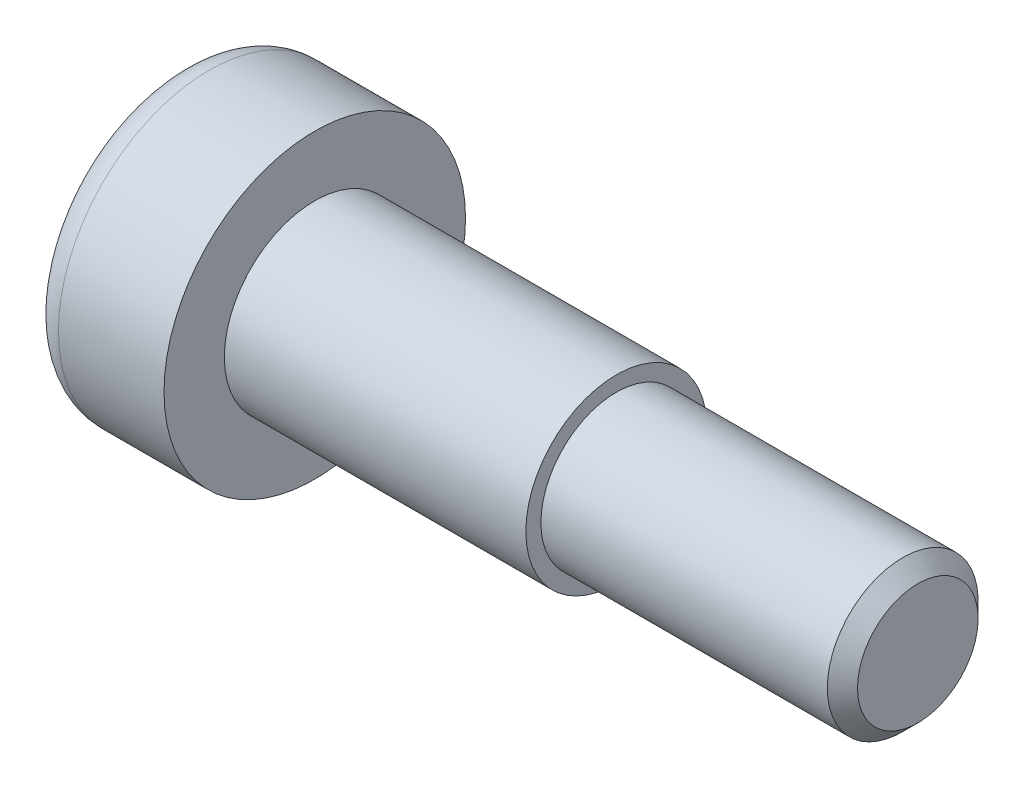
ISO-10303-21;
HEADER;
FILE_DESCRIPTION(('STEP AP214'),'2;1');
FILE_NAME('part.step','',(''),(''),'','','');
FILE_SCHEMA(('AUTOMOTIVE_DESIGN { 1 0 10303 214 1 1 1 1 }'));
ENDSEC;
DATA;
#1=APPLICATION_CONTEXT('core data for automotive mechanical design processes');
#2=APPLICATION_PROTOCOL_DEFINITION('international standard','automotive_design',2000,#1);
#3=PRODUCT_CONTEXT('',#1,'mechanical');
#4=PRODUCT('Part','Part','',(#3));
#5=PRODUCT_RELATED_PRODUCT_CATEGORY('part','',(#4));
#6=PRODUCT_DEFINITION_FORMATION('','',#4);
#7=PRODUCT_DEFINITION_CONTEXT('part definition',#1,'design');
#8=PRODUCT_DEFINITION('design','',#6,#7);
#9=PRODUCT_DEFINITION_SHAPE('','',#8);
#10=(LENGTH_UNIT() NAMED_UNIT(*) SI_UNIT(.MILLI.,.METRE.));
#11=(NAMED_UNIT(*) PLANE_ANGLE_UNIT() SI_UNIT($,.RADIAN.));
#12=(NAMED_UNIT(*) SI_UNIT($,.STERADIAN.) SOLID_ANGLE_UNIT());
#13=UNCERTAINTY_MEASURE_WITH_UNIT(LENGTH_MEASURE(1.E-05),#10,'distance_accuracy_value','');
#14=(GEOMETRIC_REPRESENTATION_CONTEXT(3) GLOBAL_UNCERTAINTY_ASSIGNED_CONTEXT((#13)) GLOBAL_UNIT_ASSIGNED_CONTEXT((#10,
#11,#12)) REPRESENTATION_CONTEXT('',''));
#15=CARTESIAN_POINT('',(0.,0.,0.));
#16=DIRECTION('',(0.,0.,1.));
#17=DIRECTION('',(1.,0.,0.));
#18=AXIS2_PLACEMENT_3D('',#15,#16,#17);
#19=CARTESIAN_POINT('',(0.,0.,0.));
#20=DIRECTION('',(1.,0.,0.));
#21=DIRECTION('',(0.,0.,-1.));
#22=AXIS2_PLACEMENT_3D('',#19,#20,#21);
#23=PLANE('',#22);
#24=CARTESIAN_POINT('',(0.,0.,0.));
#25=DIRECTION('',(1.,0.,0.));
#26=DIRECTION('',(0.,0.,-1.));
#27=AXIS2_PLACEMENT_3D('',#24,#25,#26);
#28=CIRCLE('',#27,4.);
#29=CARTESIAN_POINT('',(0.,0.,-4.));
#30=VERTEX_POINT('',#29);
#31=EDGE_CURVE('E157',#30,#30,#28,.F.);
#32=ORIENTED_EDGE('',*,*,#31,.T.);
#33=EDGE_LOOP('',(#32));
#34=FACE_BOUND('',#33,.T.);
#35=DIRECTION('',(0.,-0.5,-0.866025403784439));
#36=VECTOR('',#35,1.);
#37=CARTESIAN_POINT('',(0.,1.73205080756888,0.));
#38=LINE('',#37,#36);
#39=CARTESIAN_POINT('',(0.,1.73205080756888,0.));
#40=VERTEX_POINT('',#39);
#41=CARTESIAN_POINT('',(0.,0.866025403784439,-1.5));
#42=VERTEX_POINT('',#41);
#43=EDGE_CURVE('E127',#40,#42,#38,.T.);
#44=ORIENTED_EDGE('',*,*,#43,.F.);
#45=DIRECTION('',(0.,0.5,-0.866025403784439));
#46=VECTOR('',#45,1.);
#47=CARTESIAN_POINT('',(0.,0.86602540378444,1.5));
#48=LINE('',#47,#46);
#49=CARTESIAN_POINT('',(0.,0.86602540378444,1.5));
#50=VERTEX_POINT('',#49);
#51=EDGE_CURVE('E53',#50,#40,#48,.T.);
#52=ORIENTED_EDGE('',*,*,#51,.F.);
#53=DIRECTION('',(0.,1.,0.));
#54=VECTOR('',#53,1.);
#55=CARTESIAN_POINT('',(0.,-0.866025403784439,1.5));
#56=LINE('',#55,#54);
#57=CARTESIAN_POINT('',(0.,-0.866025403784439,1.5));
#58=VERTEX_POINT('',#57);
#59=EDGE_CURVE('E136',#58,#50,#56,.T.);
#60=ORIENTED_EDGE('',*,*,#59,.F.);
#61=DIRECTION('',(0.,0.5,0.866025403784439));
#62=VECTOR('',#61,1.);
#63=CARTESIAN_POINT('',(0.,-1.73205080756888,0.));
#64=LINE('',#63,#62);
#65=CARTESIAN_POINT('',(0.,-1.73205080756888,0.));
#66=VERTEX_POINT('',#65);
#67=EDGE_CURVE('E134',#66,#58,#64,.T.);
#68=ORIENTED_EDGE('',*,*,#67,.F.);
#69=DIRECTION('',(0.,-0.5,0.866025403784439));
#70=VECTOR('',#69,1.);
#71=CARTESIAN_POINT('',(0.,-0.866025403784439,-1.5));
#72=LINE('',#71,#70);
#73=CARTESIAN_POINT('',(0.,-0.866025403784439,-1.5));
#74=VERTEX_POINT('',#73);
#75=EDGE_CURVE('E101',#74,#66,#72,.T.);
#76=ORIENTED_EDGE('',*,*,#75,.F.);
#77=DIRECTION('',(0.,-1.,0.));
#78=VECTOR('',#77,1.);
#79=CARTESIAN_POINT('',(0.,0.866025403784439,-1.5));
#80=LINE('',#79,#78);
#81=EDGE_CURVE('E130',#42,#74,#80,.T.);
#82=ORIENTED_EDGE('',*,*,#81,.F.);
#83=EDGE_LOOP('',(#44,#52,#60,#68,#76,#82));
#84=FACE_BOUND('',#83,.T.);
#85=ADVANCED_FACE('F38',(#34,#84),#23,.F.);
#86=CARTESIAN_POINT('',(0.,0.,0.));
#87=DIRECTION('',(-1.,0.,0.));
#88=DIRECTION('',(0.,0.,1.));
#89=AXIS2_PLACEMENT_3D('',#86,#87,#88);
#90=CYLINDRICAL_SURFACE('',#89,5.);
#91=CARTESIAN_POINT('',(1.,0.,0.));
#92=DIRECTION('',(1.,0.,0.));
#93=DIRECTION('',(0.,0.,-1.));
#94=AXIS2_PLACEMENT_3D('',#91,#92,#93);
#95=CIRCLE('',#94,5.);
#96=CARTESIAN_POINT('',(1.,0.,-5.));
#97=VERTEX_POINT('',#96);
#98=EDGE_CURVE('E160',#97,#97,#95,.T.);
#99=ORIENTED_EDGE('',*,*,#98,.T.);
#100=EDGE_LOOP('',(#99));
#101=FACE_BOUND('',#100,.T.);
#102=CARTESIAN_POINT('',(4.5,0.,0.));
#103=DIRECTION('',(-1.,0.,0.));
#104=DIRECTION('',(0.,0.,1.));
#105=AXIS2_PLACEMENT_3D('',#102,#103,#104);
#106=CIRCLE('',#105,5.);
#107=CARTESIAN_POINT('',(4.5,0.,5.));
#108=VERTEX_POINT('',#107);
#109=EDGE_CURVE('E154',#108,#108,#106,.T.);
#110=ORIENTED_EDGE('',*,*,#109,.T.);
#111=EDGE_LOOP('',(#110));
#112=FACE_BOUND('',#111,.T.);
#113=ADVANCED_FACE('F177',(#101,#112),#90,.T.);
#114=CARTESIAN_POINT('',(4.5,5.,0.));
#115=DIRECTION('',(-1.,0.,0.));
#116=DIRECTION('',(0.,0.,1.));
#117=AXIS2_PLACEMENT_3D('',#114,#115,#116);
#118=PLANE('',#117);
#119=ORIENTED_EDGE('',*,*,#109,.F.);
#120=EDGE_LOOP('',(#119));
#121=FACE_BOUND('',#120,.T.);
#122=CARTESIAN_POINT('',(4.5,0.,0.));
#123=DIRECTION('',(-1.,0.,0.));
#124=DIRECTION('',(0.,0.,1.));
#125=AXIS2_PLACEMENT_3D('',#122,#123,#124);
#126=CIRCLE('',#125,3.);
#127=CARTESIAN_POINT('',(4.5,0.,3.));
#128=VERTEX_POINT('',#127);
#129=EDGE_CURVE('E151',#128,#128,#126,.T.);
#130=ORIENTED_EDGE('',*,*,#129,.T.);
#131=EDGE_LOOP('',(#130));
#132=FACE_BOUND('',#131,.T.);
#133=ADVANCED_FACE('F183',(#121,#132),#118,.F.);
#134=CARTESIAN_POINT('',(0.,0.,0.));
#135=DIRECTION('',(-1.,0.,0.));
#136=DIRECTION('',(0.,0.,1.));
#137=AXIS2_PLACEMENT_3D('',#134,#135,#136);
#138=CYLINDRICAL_SURFACE('',#137,3.);
#139=ORIENTED_EDGE('',*,*,#129,.F.);
#140=EDGE_LOOP('',(#139));
#141=FACE_BOUND('',#140,.T.);
#142=CARTESIAN_POINT('',(14.5,0.,0.));
#143=DIRECTION('',(-1.,0.,0.));
#144=DIRECTION('',(0.,0.,1.));
#145=AXIS2_PLACEMENT_3D('',#142,#143,#144);
#146=CIRCLE('',#145,3.);
#147=CARTESIAN_POINT('',(14.5,0.,3.));
#148=VERTEX_POINT('',#147);
#149=EDGE_CURVE('E148',#148,#148,#146,.T.);
#150=ORIENTED_EDGE('',*,*,#149,.T.);
#151=EDGE_LOOP('',(#150));
#152=FACE_BOUND('',#151,.T.);
#153=ADVANCED_FACE('F190',(#141,#152),#138,.T.);
#154=CARTESIAN_POINT('',(14.5,3.,0.));
#155=DIRECTION('',(-1.,0.,0.));
#156=DIRECTION('',(0.,0.,1.));
#157=AXIS2_PLACEMENT_3D('',#154,#155,#156);
#158=PLANE('',#157);
#159=ORIENTED_EDGE('',*,*,#149,.F.);
#160=EDGE_LOOP('',(#159));
#161=FACE_BOUND('',#160,.T.);
#162=CARTESIAN_POINT('',(14.5,0.,0.));
#163=DIRECTION('',(-1.,0.,0.));
#164=DIRECTION('',(0.,0.,1.));
#165=AXIS2_PLACEMENT_3D('',#162,#163,#164);
#166=CIRCLE('',#165,2.5);
#167=CARTESIAN_POINT('',(14.5,0.,2.5));
#168=VERTEX_POINT('',#167);
#169=EDGE_CURVE('E140',#168,#168,#166,.T.);
#170=ORIENTED_EDGE('',*,*,#169,.T.);
#171=EDGE_LOOP('',(#170));
#172=FACE_BOUND('',#171,.T.);
#173=ADVANCED_FACE('F194',(#161,#172),#158,.F.);
#174=CARTESIAN_POINT('',(0.,0.,0.));
#175=DIRECTION('',(-1.,0.,0.));
#176=DIRECTION('',(0.,0.,1.));
#177=AXIS2_PLACEMENT_3D('',#174,#175,#176);
#178=CYLINDRICAL_SURFACE('',#177,2.5);
#179=CARTESIAN_POINT('',(24.,0.,0.));
#180=DIRECTION('',(-1.,0.,0.));
#181=DIRECTION('',(0.,0.,1.));
#182=AXIS2_PLACEMENT_3D('',#179,#180,#181);
#183=CIRCLE('',#182,2.5);
#184=CARTESIAN_POINT('',(24.,0.,2.5));
#185=VERTEX_POINT('',#184);
#186=EDGE_CURVE('E46',#185,#185,#183,.T.);
#187=ORIENTED_EDGE('',*,*,#186,.T.);
#188=EDGE_LOOP('',(#187));
#189=FACE_BOUND('',#188,.T.);
#190=ORIENTED_EDGE('',*,*,#169,.F.);
#191=EDGE_LOOP('',(#190));
#192=FACE_BOUND('',#191,.T.);
#193=ADVANCED_FACE('F165',(#189,#192),#178,.T.);
#194=CARTESIAN_POINT('',(24.5,2.5,0.));
#195=DIRECTION('',(-1.,0.,0.));
#196=DIRECTION('',(0.,0.,1.));
#197=AXIS2_PLACEMENT_3D('',#194,#195,#196);
#198=PLANE('',#197);
#199=CARTESIAN_POINT('',(24.5,0.,0.));
#200=DIRECTION('',(-1.,0.,0.));
#201=DIRECTION('',(0.,0.,1.));
#202=AXIS2_PLACEMENT_3D('',#199,#200,#201);
#203=CIRCLE('',#202,1.99999999999999);
#204=CARTESIAN_POINT('',(24.5,0.,1.99999999999999));
#205=VERTEX_POINT('',#204);
#206=EDGE_CURVE('E11',#205,#205,#203,.F.);
#207=ORIENTED_EDGE('',*,*,#206,.T.);
#208=EDGE_LOOP('',(#207));
#209=FACE_BOUND('',#208,.T.);
#210=ADVANCED_FACE('F201',(#209),#198,.F.);
#211=CARTESIAN_POINT('',(3.,0.86602540378444,1.5));
#212=DIRECTION('',(0.,0.866025403784439,0.5));
#213=DIRECTION('',(0.,-0.5,0.866025403784439));
#214=AXIS2_PLACEMENT_3D('',#211,#212,#213);
#215=PLANE('',#214);
#216=ORIENTED_EDGE('',*,*,#51,.T.);
#217=DIRECTION('',(-1.,0.,0.));
#218=VECTOR('',#217,1.);
#219=CARTESIAN_POINT('',(3.,1.73205080756888,0.));
#220=LINE('',#219,#218);
#221=CARTESIAN_POINT('',(3.,1.73205080756888,0.));
#222=VERTEX_POINT('',#221);
#223=EDGE_CURVE('E83',#222,#40,#220,.T.);
#224=ORIENTED_EDGE('',*,*,#223,.F.);
#225=DIRECTION('',(0.,0.5,-0.866025403784439));
#226=VECTOR('',#225,1.);
#227=CARTESIAN_POINT('',(3.,0.86602540378444,1.5));
#228=LINE('',#227,#226);
#229=CARTESIAN_POINT('',(3.,0.86602540378444,1.5));
#230=VERTEX_POINT('',#229);
#231=EDGE_CURVE('E138',#230,#222,#228,.T.);
#232=ORIENTED_EDGE('',*,*,#231,.F.);
#233=DIRECTION('',(-1.,0.,0.));
#234=VECTOR('',#233,1.);
#235=CARTESIAN_POINT('',(3.,0.86602540378444,1.5));
#236=LINE('',#235,#234);
#237=EDGE_CURVE('E61',#230,#50,#236,.T.);
#238=ORIENTED_EDGE('',*,*,#237,.T.);
#239=EDGE_LOOP('',(#216,#224,#232,#238));
#240=FACE_BOUND('',#239,.T.);
#241=ADVANCED_FACE('F204',(#240),#215,.F.);
#242=CARTESIAN_POINT('',(3.,-0.866025403784439,1.5));
#243=DIRECTION('',(0.,0.,1.));
#244=DIRECTION('',(1.,0.,0.));
#245=AXIS2_PLACEMENT_3D('',#242,#243,#244);
#246=PLANE('',#245);
#247=ORIENTED_EDGE('',*,*,#59,.T.);
#248=ORIENTED_EDGE('',*,*,#237,.F.);
#249=DIRECTION('',(0.,1.,0.));
#250=VECTOR('',#249,1.);
#251=CARTESIAN_POINT('',(3.,-0.866025403784439,1.5));
#252=LINE('',#251,#250);
#253=CARTESIAN_POINT('',(3.,-0.866025403784439,1.5));
#254=VERTEX_POINT('',#253);
#255=EDGE_CURVE('E113',#254,#230,#252,.T.);
#256=ORIENTED_EDGE('',*,*,#255,.F.);
#257=DIRECTION('',(-1.,0.,0.));
#258=VECTOR('',#257,1.);
#259=CARTESIAN_POINT('',(3.,-0.866025403784439,1.5));
#260=LINE('',#259,#258);
#261=EDGE_CURVE('E105',#254,#58,#260,.T.);
#262=ORIENTED_EDGE('',*,*,#261,.T.);
#263=EDGE_LOOP('',(#247,#248,#256,#262));
#264=FACE_BOUND('',#263,.T.);
#265=ADVANCED_FACE('F208',(#264),#246,.F.);
#266=CARTESIAN_POINT('',(3.,-1.73205080756888,0.));
#267=DIRECTION('',(0.,-0.866025403784439,0.5));
#268=DIRECTION('',(0.,-0.5,-0.866025403784439));
#269=AXIS2_PLACEMENT_3D('',#266,#267,#268);
#270=PLANE('',#269);
#271=ORIENTED_EDGE('',*,*,#67,.T.);
#272=ORIENTED_EDGE('',*,*,#261,.F.);
#273=DIRECTION('',(0.,0.5,0.866025403784439));
#274=VECTOR('',#273,1.);
#275=CARTESIAN_POINT('',(3.,-1.73205080756888,0.));
#276=LINE('',#275,#274);
#277=CARTESIAN_POINT('',(3.,-1.73205080756888,0.));
#278=VERTEX_POINT('',#277);
#279=EDGE_CURVE('E109',#278,#254,#276,.T.);
#280=ORIENTED_EDGE('',*,*,#279,.F.);
#281=DIRECTION('',(-1.,0.,0.));
#282=VECTOR('',#281,1.);
#283=CARTESIAN_POINT('',(3.,-1.73205080756888,0.));
#284=LINE('',#283,#282);
#285=EDGE_CURVE('E94',#278,#66,#284,.T.);
#286=ORIENTED_EDGE('',*,*,#285,.T.);
#287=EDGE_LOOP('',(#271,#272,#280,#286));
#288=FACE_BOUND('',#287,.T.);
#289=ADVANCED_FACE('F110',(#288),#270,.F.);
#290=CARTESIAN_POINT('',(3.,-0.866025403784439,-1.5));
#291=DIRECTION('',(0.,-0.866025403784438,-0.5));
#292=DIRECTION('',(0.,0.5,-0.866025403784439));
#293=AXIS2_PLACEMENT_3D('',#290,#291,#292);
#294=PLANE('',#293);
#295=ORIENTED_EDGE('',*,*,#75,.T.);
#296=ORIENTED_EDGE('',*,*,#285,.F.);
#297=DIRECTION('',(0.,-0.5,0.866025403784439));
#298=VECTOR('',#297,1.);
#299=CARTESIAN_POINT('',(3.,-0.866025403784439,-1.5));
#300=LINE('',#299,#298);
#301=CARTESIAN_POINT('',(3.,-0.866025403784439,-1.5));
#302=VERTEX_POINT('',#301);
#303=EDGE_CURVE('E98',#302,#278,#300,.T.);
#304=ORIENTED_EDGE('',*,*,#303,.F.);
#305=DIRECTION('',(-1.,0.,0.));
#306=VECTOR('',#305,1.);
#307=CARTESIAN_POINT('',(3.,-0.866025403784439,-1.5));
#308=LINE('',#307,#306);
#309=EDGE_CURVE('E106',#302,#74,#308,.T.);
#310=ORIENTED_EDGE('',*,*,#309,.T.);
#311=EDGE_LOOP('',(#295,#296,#304,#310));
#312=FACE_BOUND('',#311,.T.);
#313=ADVANCED_FACE('F96',(#312),#294,.F.);
#314=CARTESIAN_POINT('',(3.,0.866025403784439,-1.5));
#315=DIRECTION('',(0.,0.,-1.));
#316=DIRECTION('',(-1.,0.,0.));
#317=AXIS2_PLACEMENT_3D('',#314,#315,#316);
#318=PLANE('',#317);
#319=ORIENTED_EDGE('',*,*,#81,.T.);
#320=ORIENTED_EDGE('',*,*,#309,.F.);
#321=DIRECTION('',(0.,-1.,0.));
#322=VECTOR('',#321,1.);
#323=CARTESIAN_POINT('',(3.,0.866025403784439,-1.5));
#324=LINE('',#323,#322);
#325=CARTESIAN_POINT('',(3.,0.866025403784439,-1.5));
#326=VERTEX_POINT('',#325);
#327=EDGE_CURVE('E119',#326,#302,#324,.T.);
#328=ORIENTED_EDGE('',*,*,#327,.F.);
#329=DIRECTION('',(-1.,0.,0.));
#330=VECTOR('',#329,1.);
#331=CARTESIAN_POINT('',(3.,0.866025403784439,-1.5));
#332=LINE('',#331,#330);
#333=EDGE_CURVE('E143',#326,#42,#332,.T.);
#334=ORIENTED_EDGE('',*,*,#333,.T.);
#335=EDGE_LOOP('',(#319,#320,#328,#334));
#336=FACE_BOUND('',#335,.T.);
#337=ADVANCED_FACE('F212',(#336),#318,.F.);
#338=CARTESIAN_POINT('',(3.,1.73205080756888,0.));
#339=DIRECTION('',(0.,0.866025403784439,-0.5));
#340=DIRECTION('',(0.,0.5,0.866025403784439));
#341=AXIS2_PLACEMENT_3D('',#338,#339,#340);
#342=PLANE('',#341);
#343=ORIENTED_EDGE('',*,*,#43,.T.);
#344=ORIENTED_EDGE('',*,*,#333,.F.);
#345=DIRECTION('',(0.,-0.5,-0.866025403784439));
#346=VECTOR('',#345,1.);
#347=CARTESIAN_POINT('',(3.,1.73205080756888,0.));
#348=LINE('',#347,#346);
#349=EDGE_CURVE('E121',#222,#326,#348,.T.);
#350=ORIENTED_EDGE('',*,*,#349,.F.);
#351=ORIENTED_EDGE('',*,*,#223,.T.);
#352=EDGE_LOOP('',(#343,#344,#350,#351));
#353=FACE_BOUND('',#352,.T.);
#354=ADVANCED_FACE('F209',(#353),#342,.F.);
#355=CARTESIAN_POINT('',(3.,0.,0.));
#356=DIRECTION('',(-1.,0.,0.));
#357=DIRECTION('',(0.,0.,1.));
#358=AXIS2_PLACEMENT_3D('',#355,#356,#357);
#359=PLANE('',#358);
#360=ORIENTED_EDGE('',*,*,#231,.T.);
#361=ORIENTED_EDGE('',*,*,#349,.T.);
#362=ORIENTED_EDGE('',*,*,#327,.T.);
#363=ORIENTED_EDGE('',*,*,#303,.T.);
#364=ORIENTED_EDGE('',*,*,#279,.T.);
#365=ORIENTED_EDGE('',*,*,#255,.T.);
#366=EDGE_LOOP('',(#360,#361,#362,#363,#364,#365));
#367=FACE_BOUND('',#366,.T.);
#368=ADVANCED_FACE('F116',(#367),#359,.T.);
#369=CARTESIAN_POINT('',(1.,0.,0.));
#370=DIRECTION('',(1.,0.,0.));
#371=DIRECTION('',(0.,0.,-1.));
#372=AXIS2_PLACEMENT_3D('',#369,#370,#371);
#373=TOROIDAL_SURFACE('',#372,4.,1.);
#374=ORIENTED_EDGE('',*,*,#98,.F.);
#375=EDGE_LOOP('',(#374));
#376=FACE_BOUND('',#375,.T.);
#377=ORIENTED_EDGE('',*,*,#31,.F.);
#378=EDGE_LOOP('',(#377));
#379=FACE_BOUND('',#378,.T.);
#380=ADVANCED_FACE('F169',(#376,#379),#373,.T.);
#381=CARTESIAN_POINT('',(24.,0.,0.));
#382=DIRECTION('',(-1.,0.,0.));
#383=DIRECTION('',(0.,0.,1.));
#384=AXIS2_PLACEMENT_3D('',#381,#382,#383);
#385=CONICAL_SURFACE('',#384,2.5,0.785398163397454);
#386=ORIENTED_EDGE('',*,*,#206,.F.);
#387=EDGE_LOOP('',(#386));
#388=FACE_BOUND('',#387,.T.);
#389=ORIENTED_EDGE('',*,*,#186,.F.);
#390=EDGE_LOOP('',(#389));
#391=FACE_BOUND('',#390,.T.);
#392=ADVANCED_FACE('F40',(#388,#391),#385,.T.);
#393=CLOSED_SHELL('',(#85,#113,#133,#153,#173,#193,#210,#241,#265,#289,#313,#337,#354,#368,#380,#392));
#394=MANIFOLD_SOLID_BREP('B2',#393);
#395=ADVANCED_BREP_SHAPE_REPRESENTATION('',(#18,#394),#14);
#396=SHAPE_DEFINITION_REPRESENTATION(#9,#395);
ENDSEC;
END-ISO-10303-21;
